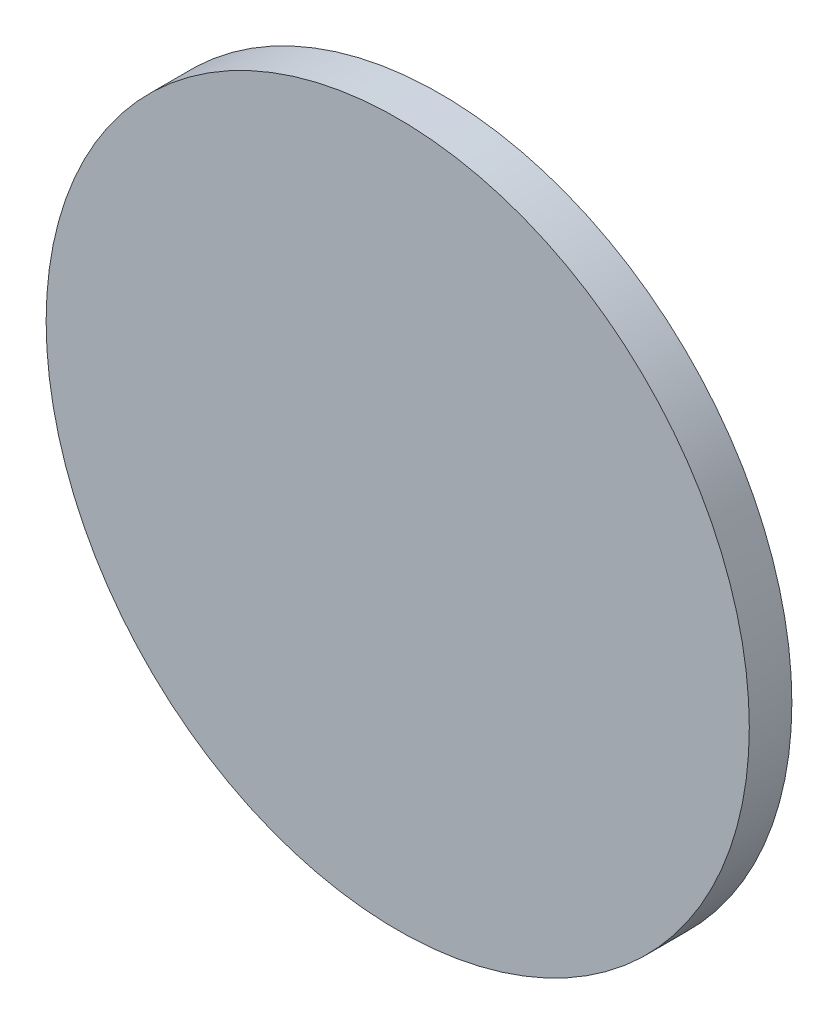
ISO-10303-21;
HEADER;
FILE_DESCRIPTION(('STEP AP214'),'2;1');
FILE_NAME('part.step','',(''),(''),'','','');
FILE_SCHEMA(('AUTOMOTIVE_DESIGN { 1 0 10303 214 1 1 1 1 }'));
ENDSEC;
DATA;
#1=APPLICATION_CONTEXT('core data for automotive mechanical design processes');
#2=APPLICATION_PROTOCOL_DEFINITION('international standard','automotive_design',2000,#1);
#3=PRODUCT_CONTEXT('',#1,'mechanical');
#4=PRODUCT('Part','Part','',(#3));
#5=PRODUCT_RELATED_PRODUCT_CATEGORY('part','',(#4));
#6=PRODUCT_DEFINITION_FORMATION('','',#4);
#7=PRODUCT_DEFINITION_CONTEXT('part definition',#1,'design');
#8=PRODUCT_DEFINITION('design','',#6,#7);
#9=PRODUCT_DEFINITION_SHAPE('','',#8);
#10=(LENGTH_UNIT() NAMED_UNIT(*) SI_UNIT(.MILLI.,.METRE.));
#11=(NAMED_UNIT(*) PLANE_ANGLE_UNIT() SI_UNIT($,.RADIAN.));
#12=(NAMED_UNIT(*) SI_UNIT($,.STERADIAN.) SOLID_ANGLE_UNIT());
#13=UNCERTAINTY_MEASURE_WITH_UNIT(LENGTH_MEASURE(1.E-05),#10,'distance_accuracy_value','');
#14=(GEOMETRIC_REPRESENTATION_CONTEXT(3) GLOBAL_UNCERTAINTY_ASSIGNED_CONTEXT((#13)) GLOBAL_UNIT_ASSIGNED_CONTEXT((#10,
#11,#12)) REPRESENTATION_CONTEXT('',''));
#15=CARTESIAN_POINT('',(0.,0.,0.));
#16=DIRECTION('',(0.,0.,1.));
#17=DIRECTION('',(1.,0.,0.));
#18=AXIS2_PLACEMENT_3D('',#15,#16,#17);
#19=CARTESIAN_POINT('',(108.614983942284,61.5655700686127,2.3));
#20=DIRECTION('',(0.,0.,-1.));
#21=DIRECTION('',(-1.,0.,0.));
#22=AXIS2_PLACEMENT_3D('',#19,#20,#21);
#23=CYLINDRICAL_SURFACE('',#22,19.);
#24=CARTESIAN_POINT('',(108.614983942284,61.5655700686127,2.3));
#25=DIRECTION('',(0.,0.,1.));
#26=DIRECTION('',(1.,0.,0.));
#27=AXIS2_PLACEMENT_3D('',#24,#25,#26);
#28=CIRCLE('',#27,19.);
#29=CARTESIAN_POINT('',(127.614983942284,61.5655700686127,2.3));
#30=VERTEX_POINT('',#29);
#31=EDGE_CURVE('E10',#30,#30,#28,.T.);
#32=ORIENTED_EDGE('',*,*,#31,.F.);
#33=EDGE_LOOP('',(#32));
#34=FACE_BOUND('',#33,.T.);
#35=CARTESIAN_POINT('',(108.614983942284,61.5655700686127,0.));
#36=DIRECTION('',(0.,0.,1.));
#37=DIRECTION('',(1.,0.,0.));
#38=AXIS2_PLACEMENT_3D('',#35,#36,#37);
#39=CIRCLE('',#38,19.);
#40=CARTESIAN_POINT('',(127.614983942284,61.5655700686127,0.));
#41=VERTEX_POINT('',#40);
#42=EDGE_CURVE('E38',#41,#41,#39,.T.);
#43=ORIENTED_EDGE('',*,*,#42,.T.);
#44=EDGE_LOOP('',(#43));
#45=FACE_BOUND('',#44,.T.);
#46=ADVANCED_FACE('F35',(#34,#45),#23,.T.);
#47=CARTESIAN_POINT('',(108.614983942284,61.5655700686127,2.3));
#48=DIRECTION('',(0.,0.,1.));
#49=DIRECTION('',(1.,0.,0.));
#50=AXIS2_PLACEMENT_3D('',#47,#48,#49);
#51=PLANE('',#50);
#52=ORIENTED_EDGE('',*,*,#31,.T.);
#53=EDGE_LOOP('',(#52));
#54=FACE_BOUND('',#53,.T.);
#55=ADVANCED_FACE('F50',(#54),#51,.T.);
#56=CARTESIAN_POINT('',(108.614983942284,61.5655700686127,0.));
#57=DIRECTION('',(0.,0.,1.));
#58=DIRECTION('',(1.,0.,0.));
#59=AXIS2_PLACEMENT_3D('',#56,#57,#58);
#60=PLANE('',#59);
#61=ORIENTED_EDGE('',*,*,#42,.F.);
#62=EDGE_LOOP('',(#61));
#63=FACE_BOUND('',#62,.T.);
#64=ADVANCED_FACE('F48',(#63),#60,.F.);
#65=CLOSED_SHELL('',(#46,#55,#64));
#66=MANIFOLD_SOLID_BREP('B2',#65);
#67=ADVANCED_BREP_SHAPE_REPRESENTATION('',(#18,#66),#14);
#68=SHAPE_DEFINITION_REPRESENTATION(#9,#67);
ENDSEC;
END-ISO-10303-21;
